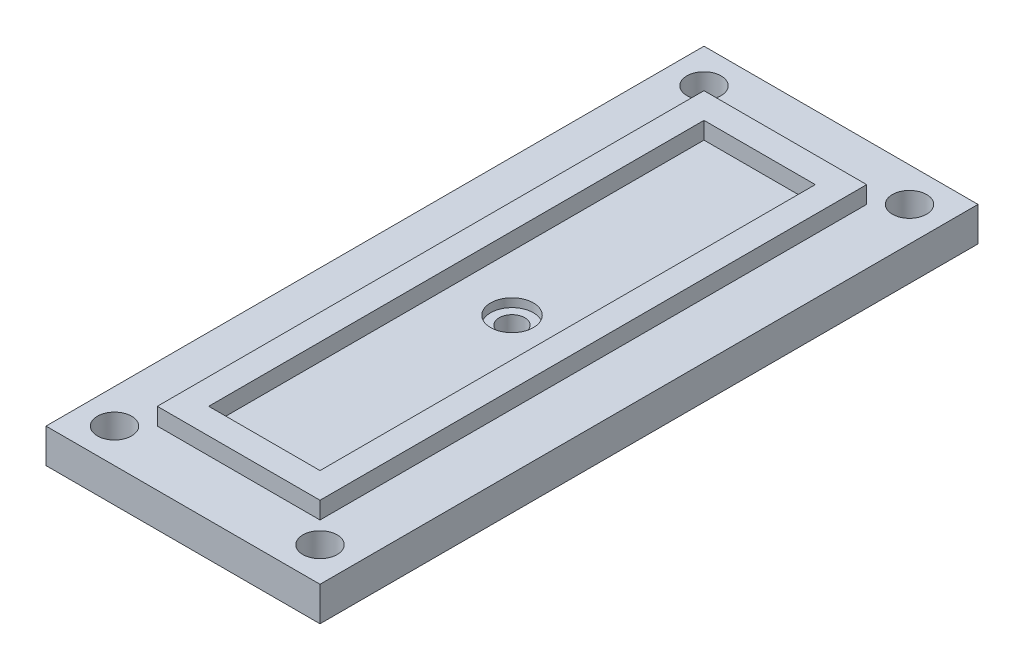
ISO-10303-21;
HEADER;
FILE_DESCRIPTION(('STEP AP214'),'2;1');
FILE_NAME('part.step','',(''),(''),'','','');
FILE_SCHEMA(('AUTOMOTIVE_DESIGN { 1 0 10303 214 1 1 1 1 }'));
ENDSEC;
DATA;
#1=APPLICATION_CONTEXT('core data for automotive mechanical design processes');
#2=APPLICATION_PROTOCOL_DEFINITION('international standard','automotive_design',2000,#1);
#3=PRODUCT_CONTEXT('',#1,'mechanical');
#4=PRODUCT('Part','Part','',(#3));
#5=PRODUCT_RELATED_PRODUCT_CATEGORY('part','',(#4));
#6=PRODUCT_DEFINITION_FORMATION('','',#4);
#7=PRODUCT_DEFINITION_CONTEXT('part definition',#1,'design');
#8=PRODUCT_DEFINITION('design','',#6,#7);
#9=PRODUCT_DEFINITION_SHAPE('','',#8);
#10=(LENGTH_UNIT() NAMED_UNIT(*) SI_UNIT(.MILLI.,.METRE.));
#11=(NAMED_UNIT(*) PLANE_ANGLE_UNIT() SI_UNIT($,.RADIAN.));
#12=(NAMED_UNIT(*) SI_UNIT($,.STERADIAN.) SOLID_ANGLE_UNIT());
#13=UNCERTAINTY_MEASURE_WITH_UNIT(LENGTH_MEASURE(1.E-05),#10,'distance_accuracy_value','');
#14=(GEOMETRIC_REPRESENTATION_CONTEXT(3) GLOBAL_UNCERTAINTY_ASSIGNED_CONTEXT((#13)) GLOBAL_UNIT_ASSIGNED_CONTEXT((#10,
#11,#12)) REPRESENTATION_CONTEXT('',''));
#15=CARTESIAN_POINT('',(0.,0.,0.));
#16=DIRECTION('',(0.,0.,1.));
#17=DIRECTION('',(1.,0.,0.));
#18=AXIS2_PLACEMENT_3D('',#15,#16,#17);
#19=CARTESIAN_POINT('',(0.,0.,0.));
#20=DIRECTION('',(0.,-1.,0.));
#21=DIRECTION('',(0.,0.,-1.));
#22=AXIS2_PLACEMENT_3D('',#19,#20,#21);
#23=PLANE('',#22);
#24=CARTESIAN_POINT('',(-5.99999999999999,0.,17.21));
#25=DIRECTION('',(0.,1.,0.));
#26=DIRECTION('',(0.,0.,-1.));
#27=AXIS2_PLACEMENT_3D('',#24,#25,#26);
#28=CIRCLE('',#27,0.999999999999998);
#29=CARTESIAN_POINT('',(-5.99999999999999,0.,16.21));
#30=VERTEX_POINT('',#29);
#31=EDGE_CURVE('E250',#30,#30,#28,.T.);
#32=ORIENTED_EDGE('',*,*,#31,.T.);
#33=EDGE_LOOP('',(#32));
#34=FACE_BOUND('',#33,.T.);
#35=CARTESIAN_POINT('',(-6.00000000000001,0.,-17.21));
#36=DIRECTION('',(0.,-1.,0.));
#37=DIRECTION('',(0.,0.,1.));
#38=AXIS2_PLACEMENT_3D('',#35,#36,#37);
#39=CIRCLE('',#38,0.999999999999998);
#40=CARTESIAN_POINT('',(-6.00000000000001,0.,-16.21));
#41=VERTEX_POINT('',#40);
#42=EDGE_CURVE('E269',#41,#41,#39,.T.);
#43=ORIENTED_EDGE('',*,*,#42,.F.);
#44=EDGE_LOOP('',(#43));
#45=FACE_BOUND('',#44,.T.);
#46=DIRECTION('',(0.,0.,-1.));
#47=VECTOR('',#46,1.);
#48=CARTESIAN_POINT('',(7.99999999999999,0.,19.21));
#49=LINE('',#48,#47);
#50=CARTESIAN_POINT('',(7.99999999999999,0.,19.21));
#51=VERTEX_POINT('',#50);
#52=CARTESIAN_POINT('',(7.99999999999999,0.,-19.21));
#53=VERTEX_POINT('',#52);
#54=EDGE_CURVE('E218',#51,#53,#49,.T.);
#55=ORIENTED_EDGE('',*,*,#54,.F.);
#56=DIRECTION('',(1.,0.,0.));
#57=VECTOR('',#56,1.);
#58=CARTESIAN_POINT('',(-8.,0.,19.21));
#59=LINE('',#58,#57);
#60=CARTESIAN_POINT('',(-8.,0.,19.21));
#61=VERTEX_POINT('',#60);
#62=EDGE_CURVE('E223',#61,#51,#59,.T.);
#63=ORIENTED_EDGE('',*,*,#62,.F.);
#64=DIRECTION('',(0.,0.,1.));
#65=VECTOR('',#64,1.);
#66=CARTESIAN_POINT('',(-8.,0.,19.21));
#67=LINE('',#66,#65);
#68=CARTESIAN_POINT('',(-8.,0.,-19.21));
#69=VERTEX_POINT('',#68);
#70=EDGE_CURVE('E234',#69,#61,#67,.T.);
#71=ORIENTED_EDGE('',*,*,#70,.F.);
#72=DIRECTION('',(-1.,0.,0.));
#73=VECTOR('',#72,1.);
#74=CARTESIAN_POINT('',(-8.,0.,-19.21));
#75=LINE('',#74,#73);
#76=EDGE_CURVE('E232',#53,#69,#75,.T.);
#77=ORIENTED_EDGE('',*,*,#76,.F.);
#78=EDGE_LOOP('',(#55,#63,#71,#77));
#79=FACE_BOUND('',#78,.T.);
#80=CARTESIAN_POINT('',(5.99999999999999,0.,17.21));
#81=DIRECTION('',(0.,-1.,0.));
#82=DIRECTION('',(0.,0.,-1.));
#83=AXIS2_PLACEMENT_3D('',#80,#81,#82);
#84=CIRCLE('',#83,0.999999999999998);
#85=CARTESIAN_POINT('',(5.99999999999999,0.,16.21));
#86=VERTEX_POINT('',#85);
#87=EDGE_CURVE('E281',#86,#86,#84,.T.);
#88=ORIENTED_EDGE('',*,*,#87,.F.);
#89=EDGE_LOOP('',(#88));
#90=FACE_BOUND('',#89,.T.);
#91=CARTESIAN_POINT('',(6.00000000000001,0.,-17.21));
#92=DIRECTION('',(0.,1.,0.));
#93=DIRECTION('',(0.,0.,1.));
#94=AXIS2_PLACEMENT_3D('',#91,#92,#93);
#95=CIRCLE('',#94,0.999999999999998);
#96=CARTESIAN_POINT('',(6.00000000000001,0.,-16.21));
#97=VERTEX_POINT('',#96);
#98=EDGE_CURVE('E275',#97,#97,#95,.T.);
#99=ORIENTED_EDGE('',*,*,#98,.T.);
#100=EDGE_LOOP('',(#99));
#101=FACE_BOUND('',#100,.T.);
#102=CARTESIAN_POINT('',(0.,0.,0.));
#103=DIRECTION('',(0.,-1.,0.));
#104=DIRECTION('',(0.,0.,-1.));
#105=AXIS2_PLACEMENT_3D('',#102,#103,#104);
#106=CIRCLE('',#105,1.5);
#107=CARTESIAN_POINT('',(0.,0.,-1.5));
#108=VERTEX_POINT('',#107);
#109=EDGE_CURVE('E261',#108,#108,#106,.T.);
#110=ORIENTED_EDGE('',*,*,#109,.F.);
#111=EDGE_LOOP('',(#110));
#112=FACE_BOUND('',#111,.T.);
#113=ADVANCED_FACE('F57',(#34,#45,#79,#90,#101,#112),#23,.T.);
#114=CARTESIAN_POINT('',(0.,0.,0.));
#115=DIRECTION('',(0.,1.,0.));
#116=DIRECTION('',(0.,0.,1.));
#117=AXIS2_PLACEMENT_3D('',#114,#115,#116);
#118=CYLINDRICAL_SURFACE('',#117,0.75);
#119=CARTESIAN_POINT('',(0.,0.,0.));
#120=DIRECTION('',(0.,1.,0.));
#121=DIRECTION('',(0.,0.,1.));
#122=AXIS2_PLACEMENT_3D('',#119,#120,#121);
#123=CIRCLE('',#122,0.75);
#124=CARTESIAN_POINT('',(0.,0.,0.75));
#125=VERTEX_POINT('',#124);
#126=EDGE_CURVE('E245',#125,#125,#123,.T.);
#127=ORIENTED_EDGE('',*,*,#126,.F.);
#128=EDGE_LOOP('',(#127));
#129=FACE_BOUND('',#128,.T.);
#130=CARTESIAN_POINT('',(0.,1.5,0.));
#131=DIRECTION('',(0.,1.,0.));
#132=DIRECTION('',(0.,0.,1.));
#133=AXIS2_PLACEMENT_3D('',#130,#131,#132);
#134=CIRCLE('',#133,0.75);
#135=CARTESIAN_POINT('',(0.,1.5,0.75));
#136=VERTEX_POINT('',#135);
#137=EDGE_CURVE('E243',#136,#136,#134,.F.);
#138=ORIENTED_EDGE('',*,*,#137,.F.);
#139=EDGE_LOOP('',(#138));
#140=FACE_BOUND('',#139,.T.);
#141=ADVANCED_FACE('F307',(#129,#140),#118,.F.);
#142=CARTESIAN_POINT('',(0.,2.,0.));
#143=DIRECTION('',(0.,-1.,0.));
#144=DIRECTION('',(0.,0.,-1.));
#145=AXIS2_PLACEMENT_3D('',#142,#143,#144);
#146=PLANE('',#145);
#147=CARTESIAN_POINT('',(6.00000000000001,2.,-17.21));
#148=DIRECTION('',(0.,-1.,0.));
#149=DIRECTION('',(0.,0.,-1.));
#150=AXIS2_PLACEMENT_3D('',#147,#148,#149);
#151=CIRCLE('',#150,0.999999999999998);
#152=CARTESIAN_POINT('',(6.00000000000001,2.,-18.21));
#153=VERTEX_POINT('',#152);
#154=EDGE_CURVE('E278',#153,#153,#151,.F.);
#155=ORIENTED_EDGE('',*,*,#154,.F.);
#156=EDGE_LOOP('',(#155));
#157=FACE_BOUND('',#156,.T.);
#158=CARTESIAN_POINT('',(5.99999999999999,2.,17.21));
#159=DIRECTION('',(0.,-1.,0.));
#160=DIRECTION('',(0.,0.,-1.));
#161=AXIS2_PLACEMENT_3D('',#158,#159,#160);
#162=CIRCLE('',#161,0.999999999999998);
#163=CARTESIAN_POINT('',(5.99999999999999,2.,16.21));
#164=VERTEX_POINT('',#163);
#165=EDGE_CURVE('E180',#164,#164,#162,.T.);
#166=ORIENTED_EDGE('',*,*,#165,.T.);
#167=EDGE_LOOP('',(#166));
#168=FACE_BOUND('',#167,.T.);
#169=DIRECTION('',(0.,0.,-1.));
#170=VECTOR('',#169,1.);
#171=CARTESIAN_POINT('',(7.99999999999999,2.,19.21));
#172=LINE('',#171,#170);
#173=CARTESIAN_POINT('',(7.99999999999999,2.,19.21));
#174=VERTEX_POINT('',#173);
#175=CARTESIAN_POINT('',(7.99999999999999,2.,-19.21));
#176=VERTEX_POINT('',#175);
#177=EDGE_CURVE('E219',#174,#176,#172,.T.);
#178=ORIENTED_EDGE('',*,*,#177,.T.);
#179=DIRECTION('',(-1.,0.,0.));
#180=VECTOR('',#179,1.);
#181=CARTESIAN_POINT('',(-8.,2.,-19.21));
#182=LINE('',#181,#180);
#183=CARTESIAN_POINT('',(-8.,2.,-19.21));
#184=VERTEX_POINT('',#183);
#185=EDGE_CURVE('E222',#176,#184,#182,.T.);
#186=ORIENTED_EDGE('',*,*,#185,.T.);
#187=DIRECTION('',(0.,0.,1.));
#188=VECTOR('',#187,1.);
#189=CARTESIAN_POINT('',(-8.,2.,19.21));
#190=LINE('',#189,#188);
#191=CARTESIAN_POINT('',(-8.,2.,19.21));
#192=VERTEX_POINT('',#191);
#193=EDGE_CURVE('E225',#184,#192,#190,.T.);
#194=ORIENTED_EDGE('',*,*,#193,.T.);
#195=DIRECTION('',(1.,0.,0.));
#196=VECTOR('',#195,1.);
#197=CARTESIAN_POINT('',(-8.,2.,19.21));
#198=LINE('',#197,#196);
#199=EDGE_CURVE('E227',#192,#174,#198,.T.);
#200=ORIENTED_EDGE('',*,*,#199,.T.);
#201=EDGE_LOOP('',(#178,#186,#194,#200));
#202=FACE_BOUND('',#201,.T.);
#203=DIRECTION('',(0.,0.,-1.));
#204=VECTOR('',#203,1.);
#205=CARTESIAN_POINT('',(4.75,2.,0.));
#206=LINE('',#205,#204);
#207=CARTESIAN_POINT('',(4.75,2.,15.96));
#208=VERTEX_POINT('',#207);
#209=CARTESIAN_POINT('',(4.75,2.,-15.96));
#210=VERTEX_POINT('',#209);
#211=EDGE_CURVE('E165',#208,#210,#206,.T.);
#212=ORIENTED_EDGE('',*,*,#211,.F.);
#213=DIRECTION('',(1.,0.,0.));
#214=VECTOR('',#213,1.);
#215=CARTESIAN_POINT('',(0.,2.,15.96));
#216=LINE('',#215,#214);
#217=CARTESIAN_POINT('',(-4.75,2.,15.96));
#218=VERTEX_POINT('',#217);
#219=EDGE_CURVE('E195',#218,#208,#216,.T.);
#220=ORIENTED_EDGE('',*,*,#219,.F.);
#221=DIRECTION('',(0.,0.,1.));
#222=VECTOR('',#221,1.);
#223=CARTESIAN_POINT('',(-4.75,2.,0.));
#224=LINE('',#223,#222);
#225=CARTESIAN_POINT('',(-4.75,2.,-15.96));
#226=VERTEX_POINT('',#225);
#227=EDGE_CURVE('E79',#226,#218,#224,.T.);
#228=ORIENTED_EDGE('',*,*,#227,.F.);
#229=DIRECTION('',(-1.,0.,0.));
#230=VECTOR('',#229,1.);
#231=CARTESIAN_POINT('',(0.,2.,-15.96));
#232=LINE('',#231,#230);
#233=EDGE_CURVE('E74',#210,#226,#232,.T.);
#234=ORIENTED_EDGE('',*,*,#233,.F.);
#235=EDGE_LOOP('',(#212,#220,#228,#234));
#236=FACE_BOUND('',#235,.T.);
#237=CARTESIAN_POINT('',(-6.00000000000001,2.,-17.21));
#238=DIRECTION('',(0.,-1.,0.));
#239=DIRECTION('',(0.,0.,-1.));
#240=AXIS2_PLACEMENT_3D('',#237,#238,#239);
#241=CIRCLE('',#240,0.999999999999998);
#242=CARTESIAN_POINT('',(-6.00000000000001,2.,-18.21));
#243=VERTEX_POINT('',#242);
#244=EDGE_CURVE('E272',#243,#243,#241,.T.);
#245=ORIENTED_EDGE('',*,*,#244,.T.);
#246=EDGE_LOOP('',(#245));
#247=FACE_BOUND('',#246,.T.);
#248=CARTESIAN_POINT('',(-5.99999999999999,2.,17.21));
#249=DIRECTION('',(0.,-1.,0.));
#250=DIRECTION('',(0.,0.,-1.));
#251=AXIS2_PLACEMENT_3D('',#248,#249,#250);
#252=CIRCLE('',#251,0.999999999999998);
#253=CARTESIAN_POINT('',(-5.99999999999999,2.,16.21));
#254=VERTEX_POINT('',#253);
#255=EDGE_CURVE('E266',#254,#254,#252,.F.);
#256=ORIENTED_EDGE('',*,*,#255,.F.);
#257=EDGE_LOOP('',(#256));
#258=FACE_BOUND('',#257,.T.);
#259=ADVANCED_FACE('F286',(#157,#168,#202,#236,#247,#258),#146,.F.);
#260=CARTESIAN_POINT('',(7.99999999999999,2.,19.21));
#261=DIRECTION('',(-1.,0.,0.));
#262=DIRECTION('',(0.,0.,1.));
#263=AXIS2_PLACEMENT_3D('',#260,#261,#262);
#264=PLANE('',#263);
#265=ORIENTED_EDGE('',*,*,#54,.T.);
#266=DIRECTION('',(0.,-1.,0.));
#267=VECTOR('',#266,1.);
#268=CARTESIAN_POINT('',(7.99999999999999,2.,-19.21));
#269=LINE('',#268,#267);
#270=EDGE_CURVE('E12',#176,#53,#269,.T.);
#271=ORIENTED_EDGE('',*,*,#270,.F.);
#272=ORIENTED_EDGE('',*,*,#177,.F.);
#273=DIRECTION('',(0.,-1.,0.));
#274=VECTOR('',#273,1.);
#275=CARTESIAN_POINT('',(7.99999999999999,2.,19.21));
#276=LINE('',#275,#274);
#277=EDGE_CURVE('E229',#174,#51,#276,.T.);
#278=ORIENTED_EDGE('',*,*,#277,.T.);
#279=EDGE_LOOP('',(#265,#271,#272,#278));
#280=FACE_BOUND('',#279,.T.);
#281=ADVANCED_FACE('F59',(#280),#264,.F.);
#282=CARTESIAN_POINT('',(-8.,2.,-19.21));
#283=DIRECTION('',(0.,0.,1.));
#284=DIRECTION('',(1.,0.,0.));
#285=AXIS2_PLACEMENT_3D('',#282,#283,#284);
#286=PLANE('',#285);
#287=ORIENTED_EDGE('',*,*,#76,.T.);
#288=DIRECTION('',(0.,-1.,0.));
#289=VECTOR('',#288,1.);
#290=CARTESIAN_POINT('',(-8.,2.,-19.21));
#291=LINE('',#290,#289);
#292=EDGE_CURVE('E66',#184,#69,#291,.T.);
#293=ORIENTED_EDGE('',*,*,#292,.F.);
#294=ORIENTED_EDGE('',*,*,#185,.F.);
#295=ORIENTED_EDGE('',*,*,#270,.T.);
#296=EDGE_LOOP('',(#287,#293,#294,#295));
#297=FACE_BOUND('',#296,.T.);
#298=ADVANCED_FACE('F324',(#297),#286,.F.);
#299=CARTESIAN_POINT('',(-8.,2.,19.21));
#300=DIRECTION('',(1.,0.,0.));
#301=DIRECTION('',(0.,0.,-1.));
#302=AXIS2_PLACEMENT_3D('',#299,#300,#301);
#303=PLANE('',#302);
#304=ORIENTED_EDGE('',*,*,#70,.T.);
#305=DIRECTION('',(0.,-1.,0.));
#306=VECTOR('',#305,1.);
#307=CARTESIAN_POINT('',(-8.,2.,19.21));
#308=LINE('',#307,#306);
#309=EDGE_CURVE('E239',#192,#61,#308,.T.);
#310=ORIENTED_EDGE('',*,*,#309,.F.);
#311=ORIENTED_EDGE('',*,*,#193,.F.);
#312=ORIENTED_EDGE('',*,*,#292,.T.);
#313=EDGE_LOOP('',(#304,#310,#311,#312));
#314=FACE_BOUND('',#313,.T.);
#315=ADVANCED_FACE('F321',(#314),#303,.F.);
#316=CARTESIAN_POINT('',(-8.,2.,19.21));
#317=DIRECTION('',(0.,0.,-1.));
#318=DIRECTION('',(-1.,0.,0.));
#319=AXIS2_PLACEMENT_3D('',#316,#317,#318);
#320=PLANE('',#319);
#321=ORIENTED_EDGE('',*,*,#62,.T.);
#322=ORIENTED_EDGE('',*,*,#277,.F.);
#323=ORIENTED_EDGE('',*,*,#199,.F.);
#324=ORIENTED_EDGE('',*,*,#309,.T.);
#325=EDGE_LOOP('',(#321,#322,#323,#324));
#326=FACE_BOUND('',#325,.T.);
#327=ADVANCED_FACE('F318',(#326),#320,.F.);
#328=CARTESIAN_POINT('',(0.,3.,0.));
#329=DIRECTION('',(0.,1.,0.));
#330=DIRECTION('',(0.,0.,1.));
#331=AXIS2_PLACEMENT_3D('',#328,#329,#330);
#332=PLANE('',#331);
#333=DIRECTION('',(0.,0.,-1.));
#334=VECTOR('',#333,1.);
#335=CARTESIAN_POINT('',(4.75,3.,0.));
#336=LINE('',#335,#334);
#337=CARTESIAN_POINT('',(4.75,3.,15.96));
#338=VERTEX_POINT('',#337);
#339=CARTESIAN_POINT('',(4.75,3.,-15.96));
#340=VERTEX_POINT('',#339);
#341=EDGE_CURVE('E191',#338,#340,#336,.T.);
#342=ORIENTED_EDGE('',*,*,#341,.T.);
#343=DIRECTION('',(-1.,0.,0.));
#344=VECTOR('',#343,1.);
#345=CARTESIAN_POINT('',(0.,3.,-15.96));
#346=LINE('',#345,#344);
#347=CARTESIAN_POINT('',(-4.75,3.,-15.96));
#348=VERTEX_POINT('',#347);
#349=EDGE_CURVE('E194',#340,#348,#346,.T.);
#350=ORIENTED_EDGE('',*,*,#349,.T.);
#351=DIRECTION('',(0.,0.,1.));
#352=VECTOR('',#351,1.);
#353=CARTESIAN_POINT('',(-4.75,3.,0.));
#354=LINE('',#353,#352);
#355=CARTESIAN_POINT('',(-4.75,3.,15.96));
#356=VERTEX_POINT('',#355);
#357=EDGE_CURVE('E197',#348,#356,#354,.T.);
#358=ORIENTED_EDGE('',*,*,#357,.T.);
#359=DIRECTION('',(1.,0.,0.));
#360=VECTOR('',#359,1.);
#361=CARTESIAN_POINT('',(0.,3.,15.96));
#362=LINE('',#361,#360);
#363=EDGE_CURVE('E199',#356,#338,#362,.T.);
#364=ORIENTED_EDGE('',*,*,#363,.T.);
#365=EDGE_LOOP('',(#342,#350,#358,#364));
#366=FACE_BOUND('',#365,.T.);
#367=DIRECTION('',(-1.,0.,0.));
#368=VECTOR('',#367,1.);
#369=CARTESIAN_POINT('',(0.,3.,-14.46));
#370=LINE('',#369,#368);
#371=CARTESIAN_POINT('',(3.25,3.,-14.46));
#372=VERTEX_POINT('',#371);
#373=CARTESIAN_POINT('',(-3.25,3.,-14.46));
#374=VERTEX_POINT('',#373);
#375=EDGE_CURVE('E157',#372,#374,#370,.T.);
#376=ORIENTED_EDGE('',*,*,#375,.F.);
#377=DIRECTION('',(0.,0.,-1.));
#378=VECTOR('',#377,1.);
#379=CARTESIAN_POINT('',(3.25,3.,0.));
#380=LINE('',#379,#378);
#381=CARTESIAN_POINT('',(3.25,3.,14.46));
#382=VERTEX_POINT('',#381);
#383=EDGE_CURVE('E147',#382,#372,#380,.T.);
#384=ORIENTED_EDGE('',*,*,#383,.F.);
#385=DIRECTION('',(1.,0.,0.));
#386=VECTOR('',#385,1.);
#387=CARTESIAN_POINT('',(0.,3.,14.46));
#388=LINE('',#387,#386);
#389=CARTESIAN_POINT('',(-3.25,3.,14.46));
#390=VERTEX_POINT('',#389);
#391=EDGE_CURVE('E173',#390,#382,#388,.T.);
#392=ORIENTED_EDGE('',*,*,#391,.F.);
#393=DIRECTION('',(0.,0.,1.));
#394=VECTOR('',#393,1.);
#395=CARTESIAN_POINT('',(-3.25,3.,0.));
#396=LINE('',#395,#394);
#397=EDGE_CURVE('E171',#374,#390,#396,.T.);
#398=ORIENTED_EDGE('',*,*,#397,.F.);
#399=EDGE_LOOP('',(#376,#384,#392,#398));
#400=FACE_BOUND('',#399,.T.);
#401=ADVANCED_FACE('F169',(#366,#400),#332,.T.);
#402=CARTESIAN_POINT('',(4.75,3.,0.));
#403=DIRECTION('',(-1.,0.,0.));
#404=DIRECTION('',(0.,0.,1.));
#405=AXIS2_PLACEMENT_3D('',#402,#403,#404);
#406=PLANE('',#405);
#407=ORIENTED_EDGE('',*,*,#211,.T.);
#408=DIRECTION('',(0.,-1.,0.));
#409=VECTOR('',#408,1.);
#410=CARTESIAN_POINT('',(4.75,3.,-15.96));
#411=LINE('',#410,#409);
#412=EDGE_CURVE('E216',#340,#210,#411,.T.);
#413=ORIENTED_EDGE('',*,*,#412,.F.);
#414=ORIENTED_EDGE('',*,*,#341,.F.);
#415=DIRECTION('',(0.,-1.,0.));
#416=VECTOR('',#415,1.);
#417=CARTESIAN_POINT('',(4.75,3.,15.96));
#418=LINE('',#417,#416);
#419=EDGE_CURVE('E201',#338,#208,#418,.T.);
#420=ORIENTED_EDGE('',*,*,#419,.T.);
#421=EDGE_LOOP('',(#407,#413,#414,#420));
#422=FACE_BOUND('',#421,.T.);
#423=ADVANCED_FACE('F527',(#422),#406,.F.);
#424=CARTESIAN_POINT('',(0.,3.,-15.96));
#425=DIRECTION('',(0.,0.,1.));
#426=DIRECTION('',(1.,0.,0.));
#427=AXIS2_PLACEMENT_3D('',#424,#425,#426);
#428=PLANE('',#427);
#429=ORIENTED_EDGE('',*,*,#233,.T.);
#430=DIRECTION('',(0.,-1.,0.));
#431=VECTOR('',#430,1.);
#432=CARTESIAN_POINT('',(-4.75,3.,-15.96));
#433=LINE('',#432,#431);
#434=EDGE_CURVE('E213',#348,#226,#433,.T.);
#435=ORIENTED_EDGE('',*,*,#434,.F.);
#436=ORIENTED_EDGE('',*,*,#349,.F.);
#437=ORIENTED_EDGE('',*,*,#412,.T.);
#438=EDGE_LOOP('',(#429,#435,#436,#437));
#439=FACE_BOUND('',#438,.T.);
#440=ADVANCED_FACE('F517',(#439),#428,.F.);
#441=CARTESIAN_POINT('',(-4.75,3.,0.));
#442=DIRECTION('',(1.,0.,0.));
#443=DIRECTION('',(0.,0.,-1.));
#444=AXIS2_PLACEMENT_3D('',#441,#442,#443);
#445=PLANE('',#444);
#446=ORIENTED_EDGE('',*,*,#227,.T.);
#447=DIRECTION('',(0.,-1.,0.));
#448=VECTOR('',#447,1.);
#449=CARTESIAN_POINT('',(-4.75,3.,15.96));
#450=LINE('',#449,#448);
#451=EDGE_CURVE('E210',#356,#218,#450,.T.);
#452=ORIENTED_EDGE('',*,*,#451,.F.);
#453=ORIENTED_EDGE('',*,*,#357,.F.);
#454=ORIENTED_EDGE('',*,*,#434,.T.);
#455=EDGE_LOOP('',(#446,#452,#453,#454));
#456=FACE_BOUND('',#455,.T.);
#457=ADVANCED_FACE('F507',(#456),#445,.F.);
#458=CARTESIAN_POINT('',(0.,3.,15.96));
#459=DIRECTION('',(0.,0.,-1.));
#460=DIRECTION('',(-1.,0.,0.));
#461=AXIS2_PLACEMENT_3D('',#458,#459,#460);
#462=PLANE('',#461);
#463=ORIENTED_EDGE('',*,*,#219,.T.);
#464=ORIENTED_EDGE('',*,*,#419,.F.);
#465=ORIENTED_EDGE('',*,*,#363,.F.);
#466=ORIENTED_EDGE('',*,*,#451,.T.);
#467=EDGE_LOOP('',(#463,#464,#465,#466));
#468=FACE_BOUND('',#467,.T.);
#469=ADVANCED_FACE('F498',(#468),#462,.F.);
#470=CARTESIAN_POINT('',(3.25,3.,0.));
#471=DIRECTION('',(-1.,0.,0.));
#472=DIRECTION('',(0.,0.,1.));
#473=AXIS2_PLACEMENT_3D('',#470,#471,#472);
#474=PLANE('',#473);
#475=DIRECTION('',(0.,0.,-1.));
#476=VECTOR('',#475,1.);
#477=CARTESIAN_POINT('',(3.25,2.,0.));
#478=LINE('',#477,#476);
#479=CARTESIAN_POINT('',(3.25,2.,14.46));
#480=VERTEX_POINT('',#479);
#481=CARTESIAN_POINT('',(3.25,2.,-14.46));
#482=VERTEX_POINT('',#481);
#483=EDGE_CURVE('E178',#480,#482,#478,.T.);
#484=ORIENTED_EDGE('',*,*,#483,.F.);
#485=DIRECTION('',(0.,-1.,0.));
#486=VECTOR('',#485,1.);
#487=CARTESIAN_POINT('',(3.25,3.,14.46));
#488=LINE('',#487,#486);
#489=EDGE_CURVE('E153',#382,#480,#488,.T.);
#490=ORIENTED_EDGE('',*,*,#489,.F.);
#491=ORIENTED_EDGE('',*,*,#383,.T.);
#492=DIRECTION('',(0.,-1.,0.));
#493=VECTOR('',#492,1.);
#494=CARTESIAN_POINT('',(3.25,3.,-14.46));
#495=LINE('',#494,#493);
#496=EDGE_CURVE('E151',#372,#482,#495,.T.);
#497=ORIENTED_EDGE('',*,*,#496,.T.);
#498=EDGE_LOOP('',(#484,#490,#491,#497));
#499=FACE_BOUND('',#498,.T.);
#500=ADVANCED_FACE('F150',(#499),#474,.T.);
#501=CARTESIAN_POINT('',(0.,3.,-14.46));
#502=DIRECTION('',(0.,0.,1.));
#503=DIRECTION('',(1.,0.,0.));
#504=AXIS2_PLACEMENT_3D('',#501,#502,#503);
#505=PLANE('',#504);
#506=DIRECTION('',(-1.,0.,0.));
#507=VECTOR('',#506,1.);
#508=CARTESIAN_POINT('',(0.,2.,-14.46));
#509=LINE('',#508,#507);
#510=CARTESIAN_POINT('',(-3.25,2.,-14.46));
#511=VERTEX_POINT('',#510);
#512=EDGE_CURVE('E164',#482,#511,#509,.T.);
#513=ORIENTED_EDGE('',*,*,#512,.F.);
#514=ORIENTED_EDGE('',*,*,#496,.F.);
#515=ORIENTED_EDGE('',*,*,#375,.T.);
#516=DIRECTION('',(0.,-1.,0.));
#517=VECTOR('',#516,1.);
#518=CARTESIAN_POINT('',(-3.25,3.,-14.46));
#519=LINE('',#518,#517);
#520=EDGE_CURVE('E166',#374,#511,#519,.T.);
#521=ORIENTED_EDGE('',*,*,#520,.T.);
#522=EDGE_LOOP('',(#513,#514,#515,#521));
#523=FACE_BOUND('',#522,.T.);
#524=ADVANCED_FACE('F161',(#523),#505,.T.);
#525=CARTESIAN_POINT('',(-3.25,3.,0.));
#526=DIRECTION('',(1.,0.,0.));
#527=DIRECTION('',(0.,0.,-1.));
#528=AXIS2_PLACEMENT_3D('',#525,#526,#527);
#529=PLANE('',#528);
#530=DIRECTION('',(0.,0.,1.));
#531=VECTOR('',#530,1.);
#532=CARTESIAN_POINT('',(-3.25,2.,0.));
#533=LINE('',#532,#531);
#534=CARTESIAN_POINT('',(-3.25,2.,14.46));
#535=VERTEX_POINT('',#534);
#536=EDGE_CURVE('E182',#511,#535,#533,.T.);
#537=ORIENTED_EDGE('',*,*,#536,.F.);
#538=ORIENTED_EDGE('',*,*,#520,.F.);
#539=ORIENTED_EDGE('',*,*,#397,.T.);
#540=DIRECTION('',(0.,-1.,0.));
#541=VECTOR('',#540,1.);
#542=CARTESIAN_POINT('',(-3.25,3.,14.46));
#543=LINE('',#542,#541);
#544=EDGE_CURVE('E188',#390,#535,#543,.T.);
#545=ORIENTED_EDGE('',*,*,#544,.T.);
#546=EDGE_LOOP('',(#537,#538,#539,#545));
#547=FACE_BOUND('',#546,.T.);
#548=ADVANCED_FACE('F472',(#547),#529,.T.);
#549=CARTESIAN_POINT('',(0.,3.,14.46));
#550=DIRECTION('',(0.,0.,-1.));
#551=DIRECTION('',(-1.,0.,0.));
#552=AXIS2_PLACEMENT_3D('',#549,#550,#551);
#553=PLANE('',#552);
#554=DIRECTION('',(1.,0.,0.));
#555=VECTOR('',#554,1.);
#556=CARTESIAN_POINT('',(0.,2.,14.46));
#557=LINE('',#556,#555);
#558=EDGE_CURVE('E158',#535,#480,#557,.T.);
#559=ORIENTED_EDGE('',*,*,#558,.F.);
#560=ORIENTED_EDGE('',*,*,#544,.F.);
#561=ORIENTED_EDGE('',*,*,#391,.T.);
#562=ORIENTED_EDGE('',*,*,#489,.T.);
#563=EDGE_LOOP('',(#559,#560,#561,#562));
#564=FACE_BOUND('',#563,.T.);
#565=ADVANCED_FACE('F302',(#564),#553,.T.);
#566=CARTESIAN_POINT('',(0.,2.,0.));
#567=DIRECTION('',(0.,1.,0.));
#568=DIRECTION('',(0.,0.,1.));
#569=AXIS2_PLACEMENT_3D('',#566,#567,#568);
#570=CIRCLE('',#569,1.25);
#571=CARTESIAN_POINT('',(0.,2.,1.25));
#572=VERTEX_POINT('',#571);
#573=EDGE_CURVE('E253',#572,#572,#570,.T.);
#574=ORIENTED_EDGE('',*,*,#573,.F.);
#575=EDGE_LOOP('',(#574));
#576=FACE_BOUND('',#575,.T.);
#577=ORIENTED_EDGE('',*,*,#558,.T.);
#578=ORIENTED_EDGE('',*,*,#483,.T.);
#579=ORIENTED_EDGE('',*,*,#512,.T.);
#580=ORIENTED_EDGE('',*,*,#536,.T.);
#581=EDGE_LOOP('',(#577,#578,#579,#580));
#582=FACE_BOUND('',#581,.T.);
#583=ADVANCED_FACE('F292',(#576,#582),#146,.F.);
#584=CARTESIAN_POINT('',(5.99999999999999,3.,17.21));
#585=DIRECTION('',(0.,-1.,0.));
#586=DIRECTION('',(0.,0.,-1.));
#587=AXIS2_PLACEMENT_3D('',#584,#585,#586);
#588=CYLINDRICAL_SURFACE('',#587,0.999999999999998);
#589=ORIENTED_EDGE('',*,*,#87,.T.);
#590=EDGE_LOOP('',(#589));
#591=FACE_BOUND('',#590,.T.);
#592=ORIENTED_EDGE('',*,*,#165,.F.);
#593=EDGE_LOOP('',(#592));
#594=FACE_BOUND('',#593,.T.);
#595=ADVANCED_FACE('F289',(#591,#594),#588,.F.);
#596=CARTESIAN_POINT('',(6.00000000000001,3.,-17.21));
#597=DIRECTION('',(0.,-1.,0.));
#598=DIRECTION('',(0.,0.,-1.));
#599=AXIS2_PLACEMENT_3D('',#596,#597,#598);
#600=CYLINDRICAL_SURFACE('',#599,0.999999999999998);
#601=ORIENTED_EDGE('',*,*,#98,.F.);
#602=EDGE_LOOP('',(#601));
#603=FACE_BOUND('',#602,.T.);
#604=ORIENTED_EDGE('',*,*,#154,.T.);
#605=EDGE_LOOP('',(#604));
#606=FACE_BOUND('',#605,.T.);
#607=ADVANCED_FACE('F291',(#603,#606),#600,.F.);
#608=CARTESIAN_POINT('',(-6.00000000000001,3.,-17.21));
#609=DIRECTION('',(0.,-1.,0.));
#610=DIRECTION('',(0.,0.,-1.));
#611=AXIS2_PLACEMENT_3D('',#608,#609,#610);
#612=CYLINDRICAL_SURFACE('',#611,0.999999999999998);
#613=ORIENTED_EDGE('',*,*,#42,.T.);
#614=EDGE_LOOP('',(#613));
#615=FACE_BOUND('',#614,.T.);
#616=ORIENTED_EDGE('',*,*,#244,.F.);
#617=EDGE_LOOP('',(#616));
#618=FACE_BOUND('',#617,.T.);
#619=ADVANCED_FACE('F299',(#615,#618),#612,.F.);
#620=CARTESIAN_POINT('',(-5.99999999999999,3.,17.21));
#621=DIRECTION('',(0.,-1.,0.));
#622=DIRECTION('',(0.,0.,-1.));
#623=AXIS2_PLACEMENT_3D('',#620,#621,#622);
#624=CYLINDRICAL_SURFACE('',#623,0.999999999999998);
#625=ORIENTED_EDGE('',*,*,#31,.F.);
#626=EDGE_LOOP('',(#625));
#627=FACE_BOUND('',#626,.T.);
#628=ORIENTED_EDGE('',*,*,#255,.T.);
#629=EDGE_LOOP('',(#628));
#630=FACE_BOUND('',#629,.T.);
#631=ADVANCED_FACE('F351',(#627,#630),#624,.F.);
#632=CARTESIAN_POINT('',(0.,1.5,0.));
#633=DIRECTION('',(0.,1.,0.));
#634=DIRECTION('',(0.,0.,1.));
#635=AXIS2_PLACEMENT_3D('',#632,#633,#634);
#636=PLANE('',#635);
#637=CARTESIAN_POINT('',(0.,1.5,0.));
#638=DIRECTION('',(0.,1.,0.));
#639=DIRECTION('',(0.,0.,1.));
#640=AXIS2_PLACEMENT_3D('',#637,#638,#639);
#641=CIRCLE('',#640,1.25);
#642=CARTESIAN_POINT('',(0.,1.5,1.25));
#643=VERTEX_POINT('',#642);
#644=EDGE_CURVE('E246',#643,#643,#641,.T.);
#645=ORIENTED_EDGE('',*,*,#644,.T.);
#646=EDGE_LOOP('',(#645));
#647=FACE_BOUND('',#646,.T.);
#648=ORIENTED_EDGE('',*,*,#137,.T.);
#649=EDGE_LOOP('',(#648));
#650=FACE_BOUND('',#649,.T.);
#651=ADVANCED_FACE('F353',(#647,#650),#636,.T.);
#652=CARTESIAN_POINT('',(0.,1.5,0.));
#653=DIRECTION('',(0.,1.,0.));
#654=DIRECTION('',(0.,0.,1.));
#655=AXIS2_PLACEMENT_3D('',#652,#653,#654);
#656=CYLINDRICAL_SURFACE('',#655,1.25);
#657=ORIENTED_EDGE('',*,*,#644,.F.);
#658=EDGE_LOOP('',(#657));
#659=FACE_BOUND('',#658,.T.);
#660=ORIENTED_EDGE('',*,*,#573,.T.);
#661=EDGE_LOOP('',(#660));
#662=FACE_BOUND('',#661,.T.);
#663=ADVANCED_FACE('F360',(#659,#662),#656,.F.);
#664=CARTESIAN_POINT('',(0.,-1.,0.));
#665=DIRECTION('',(0.,-1.,0.));
#666=DIRECTION('',(0.,0.,-1.));
#667=AXIS2_PLACEMENT_3D('',#664,#665,#666);
#668=PLANE('',#667);
#669=CARTESIAN_POINT('',(0.,-1.,0.));
#670=DIRECTION('',(0.,-1.,0.));
#671=DIRECTION('',(0.,0.,-1.));
#672=AXIS2_PLACEMENT_3D('',#669,#670,#671);
#673=CIRCLE('',#672,0.25);
#674=CARTESIAN_POINT('',(0.,-1.,-0.25));
#675=VERTEX_POINT('',#674);
#676=EDGE_CURVE('E389',#675,#675,#673,.T.);
#677=ORIENTED_EDGE('',*,*,#676,.F.);
#678=EDGE_LOOP('',(#677));
#679=FACE_BOUND('',#678,.T.);
#680=CARTESIAN_POINT('',(0.,-1.,0.));
#681=DIRECTION('',(0.,-1.,0.));
#682=DIRECTION('',(0.,0.,-1.));
#683=AXIS2_PLACEMENT_3D('',#680,#681,#682);
#684=CIRCLE('',#683,1.5);
#685=CARTESIAN_POINT('',(0.,-1.,-1.5));
#686=VERTEX_POINT('',#685);
#687=EDGE_CURVE('E258',#686,#686,#684,.T.);
#688=ORIENTED_EDGE('',*,*,#687,.T.);
#689=EDGE_LOOP('',(#688));
#690=FACE_BOUND('',#689,.T.);
#691=ADVANCED_FACE('F367',(#679,#690),#668,.T.);
#692=CARTESIAN_POINT('',(0.,-1.,0.));
#693=DIRECTION('',(0.,1.,0.));
#694=DIRECTION('',(0.,0.,1.));
#695=AXIS2_PLACEMENT_3D('',#692,#693,#694);
#696=CYLINDRICAL_SURFACE('',#695,1.5);
#697=ORIENTED_EDGE('',*,*,#687,.F.);
#698=EDGE_LOOP('',(#697));
#699=FACE_BOUND('',#698,.T.);
#700=ORIENTED_EDGE('',*,*,#109,.T.);
#701=EDGE_LOOP('',(#700));
#702=FACE_BOUND('',#701,.T.);
#703=ADVANCED_FACE('F370',(#699,#702),#696,.T.);
#704=CARTESIAN_POINT('',(0.,0.,0.));
#705=DIRECTION('',(0.,-1.,0.));
#706=DIRECTION('',(0.,0.,-1.));
#707=AXIS2_PLACEMENT_3D('',#704,#705,#706);
#708=PLANE('',#707);
#709=CARTESIAN_POINT('',(0.,0.,0.));
#710=DIRECTION('',(0.,-1.,0.));
#711=DIRECTION('',(0.,0.,-1.));
#712=AXIS2_PLACEMENT_3D('',#709,#710,#711);
#713=CIRCLE('',#712,0.25);
#714=CARTESIAN_POINT('',(0.,0.,-0.25));
#715=VERTEX_POINT('',#714);
#716=EDGE_CURVE('E61',#715,#715,#713,.T.);
#717=ORIENTED_EDGE('',*,*,#716,.T.);
#718=EDGE_LOOP('',(#717));
#719=FACE_BOUND('',#718,.T.);
#720=ORIENTED_EDGE('',*,*,#126,.T.);
#721=EDGE_LOOP('',(#720));
#722=FACE_BOUND('',#721,.T.);
#723=ADVANCED_FACE('F373',(#719,#722),#708,.F.);
#724=CARTESIAN_POINT('',(0.,1.,0.));
#725=DIRECTION('',(0.,-1.,0.));
#726=DIRECTION('',(0.,0.,-1.));
#727=AXIS2_PLACEMENT_3D('',#724,#725,#726);
#728=CYLINDRICAL_SURFACE('',#727,0.25);
#729=ORIENTED_EDGE('',*,*,#676,.T.);
#730=EDGE_LOOP('',(#729));
#731=FACE_BOUND('',#730,.T.);
#732=ORIENTED_EDGE('',*,*,#716,.F.);
#733=EDGE_LOOP('',(#732));
#734=FACE_BOUND('',#733,.T.);
#735=ADVANCED_FACE('F377',(#731,#734),#728,.F.);
#736=CLOSED_SHELL('',(#113,#141,#259,#281,#298,#315,#327,#401,#423,#440,#457,#469,#500,#524,
#548,#565,#583,#595,#607,#619,#631,#651,#663,#691,#703,#723,#735));
#737=MANIFOLD_SOLID_BREP('B2',#736);
#738=ADVANCED_BREP_SHAPE_REPRESENTATION('',(#18,#737),#14);
#739=SHAPE_DEFINITION_REPRESENTATION(#9,#738);
ENDSEC;
END-ISO-10303-21;
